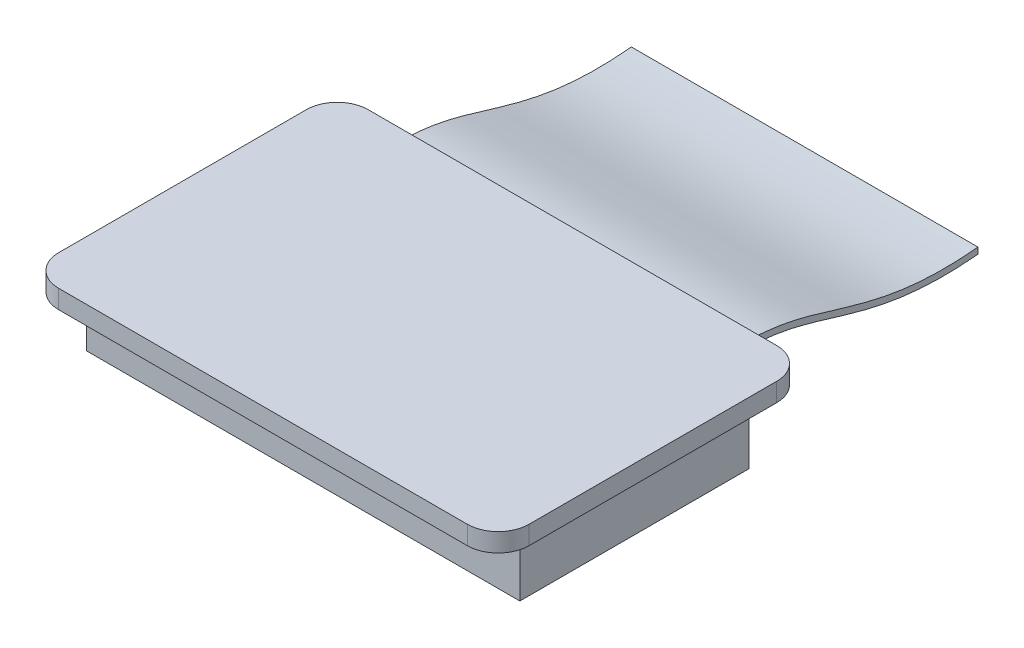
ISO-10303-21;
HEADER;
FILE_DESCRIPTION(('STEP AP214'),'2;1');
FILE_NAME('part.step','',(''),(''),'','','');
FILE_SCHEMA(('AUTOMOTIVE_DESIGN { 1 0 10303 214 1 1 1 1 }'));
ENDSEC;
DATA;
#1=APPLICATION_CONTEXT('core data for automotive mechanical design processes');
#2=APPLICATION_PROTOCOL_DEFINITION('international standard','automotive_design',2000,#1);
#3=PRODUCT_CONTEXT('',#1,'mechanical');
#4=PRODUCT('Part','Part','',(#3));
#5=PRODUCT_RELATED_PRODUCT_CATEGORY('part','',(#4));
#6=PRODUCT_DEFINITION_FORMATION('','',#4);
#7=PRODUCT_DEFINITION_CONTEXT('part definition',#1,'design');
#8=PRODUCT_DEFINITION('design','',#6,#7);
#9=PRODUCT_DEFINITION_SHAPE('','',#8);
#10=(LENGTH_UNIT() NAMED_UNIT(*) SI_UNIT(.MILLI.,.METRE.));
#11=(NAMED_UNIT(*) PLANE_ANGLE_UNIT() SI_UNIT($,.RADIAN.));
#12=(NAMED_UNIT(*) SI_UNIT($,.STERADIAN.) SOLID_ANGLE_UNIT());
#13=UNCERTAINTY_MEASURE_WITH_UNIT(LENGTH_MEASURE(1.E-05),#10,'distance_accuracy_value','');
#14=(GEOMETRIC_REPRESENTATION_CONTEXT(3) GLOBAL_UNCERTAINTY_ASSIGNED_CONTEXT((#13)) GLOBAL_UNIT_ASSIGNED_CONTEXT((#10,
#11,#12)) REPRESENTATION_CONTEXT('',''));
#15=CARTESIAN_POINT('',(0.,0.,0.));
#16=DIRECTION('',(0.,0.,1.));
#17=DIRECTION('',(1.,0.,0.));
#18=AXIS2_PLACEMENT_3D('',#15,#16,#17);
#19=CARTESIAN_POINT('',(3.3,0.748301222298696,8.25169585037883));
#20=DIRECTION('',(0.,-1.,0.));
#21=DIRECTION('',(0.,0.,-1.));
#22=AXIS2_PLACEMENT_3D('',#19,#20,#21);
#23=CYLINDRICAL_SURFACE('',#22,0.5);
#24=CARTESIAN_POINT('',(3.3,0.448301222298696,8.25169585037883));
#25=DIRECTION('',(0.,-1.,0.));
#26=DIRECTION('',(0.,0.,-1.));
#27=AXIS2_PLACEMENT_3D('',#24,#25,#26);
#28=CIRCLE('',#27,0.5);
#29=CARTESIAN_POINT('',(3.3,0.448301222298696,7.75169585037883));
#30=VERTEX_POINT('',#29);
#31=CARTESIAN_POINT('',(3.8,0.448301222298696,8.25169585037883));
#32=VERTEX_POINT('',#31);
#33=EDGE_CURVE('E174',#30,#32,#28,.T.);
#34=ORIENTED_EDGE('',*,*,#33,.F.);
#35=DIRECTION('',(0.,-1.,0.));
#36=VECTOR('',#35,1.);
#37=CARTESIAN_POINT('',(3.3,0.748301222298696,7.75169585037883));
#38=LINE('',#37,#36);
#39=CARTESIAN_POINT('',(3.3,0.748301222298696,7.75169585037883));
#40=VERTEX_POINT('',#39);
#41=EDGE_CURVE('E13',#40,#30,#38,.T.);
#42=ORIENTED_EDGE('',*,*,#41,.F.);
#43=CARTESIAN_POINT('',(3.3,0.748301222298696,8.25169585037883));
#44=DIRECTION('',(0.,-1.,0.));
#45=DIRECTION('',(0.,0.,-1.));
#46=AXIS2_PLACEMENT_3D('',#43,#44,#45);
#47=CIRCLE('',#46,0.5);
#48=CARTESIAN_POINT('',(3.8,0.748301222298696,8.25169585037883));
#49=VERTEX_POINT('',#48);
#50=EDGE_CURVE('E195',#40,#49,#47,.T.);
#51=ORIENTED_EDGE('',*,*,#50,.T.);
#52=DIRECTION('',(0.,-1.,0.));
#53=VECTOR('',#52,1.);
#54=CARTESIAN_POINT('',(3.8,0.748301222298696,8.25169585037883));
#55=LINE('',#54,#53);
#56=EDGE_CURVE('E67',#49,#32,#55,.T.);
#57=ORIENTED_EDGE('',*,*,#56,.T.);
#58=EDGE_LOOP('',(#34,#42,#51,#57));
#59=FACE_BOUND('',#58,.T.);
#60=ADVANCED_FACE('F64',(#59),#23,.T.);
#61=CARTESIAN_POINT('',(-3.3,0.748301222298696,7.75169585037883));
#62=DIRECTION('',(0.,0.,-1.));
#63=DIRECTION('',(-1.,0.,0.));
#64=AXIS2_PLACEMENT_3D('',#61,#62,#63);
#65=PLANE('',#64);
#66=DIRECTION('',(1.,0.,0.));
#67=VECTOR('',#66,1.);
#68=CARTESIAN_POINT('',(-3.3,0.448301222298696,7.75169585037883));
#69=LINE('',#68,#67);
#70=CARTESIAN_POINT('',(-3.3,0.448301222298696,7.75169585037883));
#71=VERTEX_POINT('',#70);
#72=EDGE_CURVE('E193',#71,#30,#69,.T.);
#73=ORIENTED_EDGE('',*,*,#72,.F.);
#74=DIRECTION('',(0.,-1.,0.));
#75=VECTOR('',#74,1.);
#76=CARTESIAN_POINT('',(-3.3,0.748301222298696,7.75169585037883));
#77=LINE('',#76,#75);
#78=CARTESIAN_POINT('',(-3.3,0.748301222298696,7.75169585037883));
#79=VERTEX_POINT('',#78);
#80=EDGE_CURVE('E72',#79,#71,#77,.T.);
#81=ORIENTED_EDGE('',*,*,#80,.F.);
#82=DIRECTION('',(1.,0.,0.));
#83=VECTOR('',#82,1.);
#84=CARTESIAN_POINT('',(-3.3,0.748301222298696,7.75169585037883));
#85=LINE('',#84,#83);
#86=EDGE_CURVE('E164',#79,#40,#85,.T.);
#87=ORIENTED_EDGE('',*,*,#86,.T.);
#88=ORIENTED_EDGE('',*,*,#41,.T.);
#89=EDGE_LOOP('',(#73,#81,#87,#88));
#90=FACE_BOUND('',#89,.T.);
#91=ADVANCED_FACE('F207',(#90),#65,.T.);
#92=CARTESIAN_POINT('',(-3.3,0.748301222298696,8.25169585037883));
#93=DIRECTION('',(0.,-1.,0.));
#94=DIRECTION('',(0.,0.,-1.));
#95=AXIS2_PLACEMENT_3D('',#92,#93,#94);
#96=CYLINDRICAL_SURFACE('',#95,0.5);
#97=CARTESIAN_POINT('',(-3.3,0.448301222298696,8.25169585037883));
#98=DIRECTION('',(0.,-1.,0.));
#99=DIRECTION('',(0.,0.,-1.));
#100=AXIS2_PLACEMENT_3D('',#97,#98,#99);
#101=CIRCLE('',#100,0.5);
#102=CARTESIAN_POINT('',(-3.8,0.448301222298696,8.25169585037883));
#103=VERTEX_POINT('',#102);
#104=EDGE_CURVE('E151',#103,#71,#101,.T.);
#105=ORIENTED_EDGE('',*,*,#104,.F.);
#106=DIRECTION('',(0.,-1.,0.));
#107=VECTOR('',#106,1.);
#108=CARTESIAN_POINT('',(-3.8,0.748301222298696,8.25169585037883));
#109=LINE('',#108,#107);
#110=CARTESIAN_POINT('',(-3.8,0.748301222298696,8.25169585037883));
#111=VERTEX_POINT('',#110);
#112=EDGE_CURVE('E145',#111,#103,#109,.T.);
#113=ORIENTED_EDGE('',*,*,#112,.F.);
#114=CARTESIAN_POINT('',(-3.3,0.748301222298696,8.25169585037883));
#115=DIRECTION('',(0.,-1.,0.));
#116=DIRECTION('',(0.,0.,-1.));
#117=AXIS2_PLACEMENT_3D('',#114,#115,#116);
#118=CIRCLE('',#117,0.5);
#119=EDGE_CURVE('E148',#111,#79,#118,.T.);
#120=ORIENTED_EDGE('',*,*,#119,.T.);
#121=ORIENTED_EDGE('',*,*,#80,.T.);
#122=EDGE_LOOP('',(#105,#113,#120,#121));
#123=FACE_BOUND('',#122,.T.);
#124=ADVANCED_FACE('F147',(#123),#96,.T.);
#125=CARTESIAN_POINT('',(-3.8,0.748301222298696,12.2516958503788));
#126=DIRECTION('',(-1.,0.,0.));
#127=DIRECTION('',(0.,0.,1.));
#128=AXIS2_PLACEMENT_3D('',#125,#126,#127);
#129=PLANE('',#128);
#130=DIRECTION('',(0.,0.,-1.));
#131=VECTOR('',#130,1.);
#132=CARTESIAN_POINT('',(-3.8,0.448301222298696,12.2516958503788));
#133=LINE('',#132,#131);
#134=CARTESIAN_POINT('',(-3.8,0.448301222298696,12.2516958503788));
#135=VERTEX_POINT('',#134);
#136=EDGE_CURVE('E190',#135,#103,#133,.T.);
#137=ORIENTED_EDGE('',*,*,#136,.F.);
#138=DIRECTION('',(0.,-1.,0.));
#139=VECTOR('',#138,1.);
#140=CARTESIAN_POINT('',(-3.8,0.748301222298696,12.2516958503788));
#141=LINE('',#140,#139);
#142=CARTESIAN_POINT('',(-3.8,0.748301222298696,12.2516958503788));
#143=VERTEX_POINT('',#142);
#144=EDGE_CURVE('E156',#143,#135,#141,.T.);
#145=ORIENTED_EDGE('',*,*,#144,.F.);
#146=DIRECTION('',(0.,0.,-1.));
#147=VECTOR('',#146,1.);
#148=CARTESIAN_POINT('',(-3.8,0.748301222298696,12.2516958503788));
#149=LINE('',#148,#147);
#150=EDGE_CURVE('E162',#143,#111,#149,.T.);
#151=ORIENTED_EDGE('',*,*,#150,.T.);
#152=ORIENTED_EDGE('',*,*,#112,.T.);
#153=EDGE_LOOP('',(#137,#145,#151,#152));
#154=FACE_BOUND('',#153,.T.);
#155=ADVANCED_FACE('F166',(#154),#129,.T.);
#156=CARTESIAN_POINT('',(-3.3,0.748301222298696,12.2516958503788));
#157=DIRECTION('',(0.,-1.,0.));
#158=DIRECTION('',(0.,0.,-1.));
#159=AXIS2_PLACEMENT_3D('',#156,#157,#158);
#160=CYLINDRICAL_SURFACE('',#159,0.5);
#161=CARTESIAN_POINT('',(-3.3,0.448301222298696,12.2516958503788));
#162=DIRECTION('',(0.,-1.,0.));
#163=DIRECTION('',(0.,0.,-1.));
#164=AXIS2_PLACEMENT_3D('',#161,#162,#163);
#165=CIRCLE('',#164,0.5);
#166=CARTESIAN_POINT('',(-3.3,0.448301222298696,12.7516958503788));
#167=VERTEX_POINT('',#166);
#168=EDGE_CURVE('E187',#167,#135,#165,.T.);
#169=ORIENTED_EDGE('',*,*,#168,.F.);
#170=DIRECTION('',(0.,-1.,0.));
#171=VECTOR('',#170,1.);
#172=CARTESIAN_POINT('',(-3.3,0.748301222298696,12.7516958503788));
#173=LINE('',#172,#171);
#174=CARTESIAN_POINT('',(-3.3,0.748301222298696,12.7516958503788));
#175=VERTEX_POINT('',#174);
#176=EDGE_CURVE('E199',#175,#167,#173,.T.);
#177=ORIENTED_EDGE('',*,*,#176,.F.);
#178=CARTESIAN_POINT('',(-3.3,0.748301222298696,12.2516958503788));
#179=DIRECTION('',(0.,-1.,0.));
#180=DIRECTION('',(0.,0.,-1.));
#181=AXIS2_PLACEMENT_3D('',#178,#179,#180);
#182=CIRCLE('',#181,0.5);
#183=EDGE_CURVE('E167',#175,#143,#182,.T.);
#184=ORIENTED_EDGE('',*,*,#183,.T.);
#185=ORIENTED_EDGE('',*,*,#144,.T.);
#186=EDGE_LOOP('',(#169,#177,#184,#185));
#187=FACE_BOUND('',#186,.T.);
#188=ADVANCED_FACE('F220',(#187),#160,.T.);
#189=CARTESIAN_POINT('',(-3.3,0.748301222298696,12.7516958503788));
#190=DIRECTION('',(0.,0.,1.));
#191=DIRECTION('',(1.,0.,0.));
#192=AXIS2_PLACEMENT_3D('',#189,#190,#191);
#193=PLANE('',#192);
#194=DIRECTION('',(-1.,0.,0.));
#195=VECTOR('',#194,1.);
#196=CARTESIAN_POINT('',(-3.3,0.448301222298696,12.7516958503788));
#197=LINE('',#196,#195);
#198=CARTESIAN_POINT('',(3.3,0.448301222298696,12.7516958503788));
#199=VERTEX_POINT('',#198);
#200=EDGE_CURVE('E184',#199,#167,#197,.T.);
#201=ORIENTED_EDGE('',*,*,#200,.F.);
#202=DIRECTION('',(0.,-1.,0.));
#203=VECTOR('',#202,1.);
#204=CARTESIAN_POINT('',(3.3,0.748301222298696,12.7516958503788));
#205=LINE('',#204,#203);
#206=CARTESIAN_POINT('',(3.3,0.748301222298696,12.7516958503788));
#207=VERTEX_POINT('',#206);
#208=EDGE_CURVE('E201',#207,#199,#205,.T.);
#209=ORIENTED_EDGE('',*,*,#208,.F.);
#210=DIRECTION('',(-1.,0.,0.));
#211=VECTOR('',#210,1.);
#212=CARTESIAN_POINT('',(-3.3,0.748301222298696,12.7516958503788));
#213=LINE('',#212,#211);
#214=EDGE_CURVE('E169',#207,#175,#213,.T.);
#215=ORIENTED_EDGE('',*,*,#214,.T.);
#216=ORIENTED_EDGE('',*,*,#176,.T.);
#217=EDGE_LOOP('',(#201,#209,#215,#216));
#218=FACE_BOUND('',#217,.T.);
#219=ADVANCED_FACE('F223',(#218),#193,.T.);
#220=CARTESIAN_POINT('',(3.3,0.748301222298696,12.2516958503788));
#221=DIRECTION('',(0.,-1.,0.));
#222=DIRECTION('',(0.,0.,-1.));
#223=AXIS2_PLACEMENT_3D('',#220,#221,#222);
#224=CYLINDRICAL_SURFACE('',#223,0.5);
#225=CARTESIAN_POINT('',(3.3,0.448301222298696,12.2516958503788));
#226=DIRECTION('',(0.,-1.,0.));
#227=DIRECTION('',(0.,0.,1.));
#228=AXIS2_PLACEMENT_3D('',#225,#226,#227);
#229=CIRCLE('',#228,0.5);
#230=CARTESIAN_POINT('',(3.8,0.448301222298696,12.2516958503788));
#231=VERTEX_POINT('',#230);
#232=EDGE_CURVE('E181',#231,#199,#229,.T.);
#233=ORIENTED_EDGE('',*,*,#232,.F.);
#234=DIRECTION('',(0.,-1.,0.));
#235=VECTOR('',#234,1.);
#236=CARTESIAN_POINT('',(3.8,0.748301222298696,12.2516958503788));
#237=LINE('',#236,#235);
#238=CARTESIAN_POINT('',(3.8,0.748301222298696,12.2516958503788));
#239=VERTEX_POINT('',#238);
#240=EDGE_CURVE('E202',#239,#231,#237,.T.);
#241=ORIENTED_EDGE('',*,*,#240,.F.);
#242=CARTESIAN_POINT('',(3.3,0.748301222298696,12.2516958503788));
#243=DIRECTION('',(0.,-1.,0.));
#244=DIRECTION('',(0.,0.,1.));
#245=AXIS2_PLACEMENT_3D('',#242,#243,#244);
#246=CIRCLE('',#245,0.5);
#247=EDGE_CURVE('E291',#239,#207,#246,.T.);
#248=ORIENTED_EDGE('',*,*,#247,.T.);
#249=ORIENTED_EDGE('',*,*,#208,.T.);
#250=EDGE_LOOP('',(#233,#241,#248,#249));
#251=FACE_BOUND('',#250,.T.);
#252=ADVANCED_FACE('F227',(#251),#224,.T.);
#253=CARTESIAN_POINT('',(3.8,0.748301222298696,12.2516958503788));
#254=DIRECTION('',(1.,0.,0.));
#255=DIRECTION('',(0.,0.,-1.));
#256=AXIS2_PLACEMENT_3D('',#253,#254,#255);
#257=PLANE('',#256);
#258=DIRECTION('',(0.,0.,1.));
#259=VECTOR('',#258,1.);
#260=CARTESIAN_POINT('',(3.8,0.448301222298696,12.2516958503788));
#261=LINE('',#260,#259);
#262=EDGE_CURVE('E177',#32,#231,#261,.T.);
#263=ORIENTED_EDGE('',*,*,#262,.F.);
#264=ORIENTED_EDGE('',*,*,#56,.F.);
#265=DIRECTION('',(0.,0.,1.));
#266=VECTOR('',#265,1.);
#267=CARTESIAN_POINT('',(3.8,0.748301222298696,12.2516958503788));
#268=LINE('',#267,#266);
#269=EDGE_CURVE('E289',#49,#239,#268,.T.);
#270=ORIENTED_EDGE('',*,*,#269,.T.);
#271=ORIENTED_EDGE('',*,*,#240,.T.);
#272=EDGE_LOOP('',(#263,#264,#270,#271));
#273=FACE_BOUND('',#272,.T.);
#274=ADVANCED_FACE('F204',(#273),#257,.T.);
#275=CARTESIAN_POINT('',(3.3,0.748301222298696,8.25169585037883));
#276=DIRECTION('',(0.,-1.,0.));
#277=DIRECTION('',(0.,0.,-1.));
#278=AXIS2_PLACEMENT_3D('',#275,#276,#277);
#279=PLANE('',#278);
#280=ORIENTED_EDGE('',*,*,#50,.F.);
#281=ORIENTED_EDGE('',*,*,#86,.F.);
#282=ORIENTED_EDGE('',*,*,#119,.F.);
#283=ORIENTED_EDGE('',*,*,#150,.F.);
#284=ORIENTED_EDGE('',*,*,#183,.F.);
#285=ORIENTED_EDGE('',*,*,#214,.F.);
#286=ORIENTED_EDGE('',*,*,#247,.F.);
#287=ORIENTED_EDGE('',*,*,#269,.F.);
#288=EDGE_LOOP('',(#280,#281,#282,#283,#284,#285,#286,#287));
#289=FACE_BOUND('',#288,.T.);
#290=ADVANCED_FACE('F160',(#289),#279,.F.);
#291=CARTESIAN_POINT('',(3.3,0.448301222298696,8.25169585037883));
#292=DIRECTION('',(0.,-1.,0.));
#293=DIRECTION('',(0.,0.,-1.));
#294=AXIS2_PLACEMENT_3D('',#291,#292,#293);
#295=PLANE('',#294);
#296=DIRECTION('',(0.,0.,1.));
#297=VECTOR('',#296,1.);
#298=CARTESIAN_POINT('',(3.5,0.448301222298696,12.1016958503788));
#299=LINE('',#298,#297);
#300=CARTESIAN_POINT('',(3.5,0.448301222298696,8.40169585037883));
#301=VERTEX_POINT('',#300);
#302=CARTESIAN_POINT('',(3.5,0.448301222298696,12.1016958503788));
#303=VERTEX_POINT('',#302);
#304=EDGE_CURVE('E273',#301,#303,#299,.T.);
#305=ORIENTED_EDGE('',*,*,#304,.F.);
#306=DIRECTION('',(-1.,0.,0.));
#307=VECTOR('',#306,1.);
#308=CARTESIAN_POINT('',(3.5,0.448301222298696,8.40169585037883));
#309=LINE('',#308,#307);
#310=CARTESIAN_POINT('',(-3.5,0.448301222298696,8.40169585037883));
#311=VERTEX_POINT('',#310);
#312=EDGE_CURVE('E284',#301,#311,#309,.T.);
#313=ORIENTED_EDGE('',*,*,#312,.T.);
#314=DIRECTION('',(0.,0.,1.));
#315=VECTOR('',#314,1.);
#316=CARTESIAN_POINT('',(-3.5,0.448301222298696,12.1016958503788));
#317=LINE('',#316,#315);
#318=CARTESIAN_POINT('',(-3.5,0.448301222298696,12.1016958503788));
#319=VERTEX_POINT('',#318);
#320=EDGE_CURVE('E276',#311,#319,#317,.T.);
#321=ORIENTED_EDGE('',*,*,#320,.T.);
#322=DIRECTION('',(-1.,0.,0.));
#323=VECTOR('',#322,1.);
#324=CARTESIAN_POINT('',(3.5,0.448301222298696,12.1016958503788));
#325=LINE('',#324,#323);
#326=EDGE_CURVE('E300',#303,#319,#325,.T.);
#327=ORIENTED_EDGE('',*,*,#326,.F.);
#328=EDGE_LOOP('',(#305,#313,#321,#327));
#329=FACE_BOUND('',#328,.T.);
#330=ORIENTED_EDGE('',*,*,#33,.T.);
#331=ORIENTED_EDGE('',*,*,#262,.T.);
#332=ORIENTED_EDGE('',*,*,#232,.T.);
#333=ORIENTED_EDGE('',*,*,#200,.T.);
#334=ORIENTED_EDGE('',*,*,#168,.T.);
#335=ORIENTED_EDGE('',*,*,#136,.T.);
#336=ORIENTED_EDGE('',*,*,#104,.T.);
#337=ORIENTED_EDGE('',*,*,#72,.T.);
#338=EDGE_LOOP('',(#330,#331,#332,#333,#334,#335,#336,#337));
#339=FACE_BOUND('',#338,.T.);
#340=ADVANCED_FACE('F206',(#329,#339),#295,.T.);
#341=CARTESIAN_POINT('',(3.5,0.448301222298696,12.1016958503788));
#342=DIRECTION('',(0.,0.,-1.));
#343=DIRECTION('',(-1.,0.,0.));
#344=AXIS2_PLACEMENT_3D('',#341,#342,#343);
#345=PLANE('',#344);
#346=DIRECTION('',(0.,-1.,0.));
#347=VECTOR('',#346,1.);
#348=CARTESIAN_POINT('',(-3.5,0.448301222298696,12.1016958503788));
#349=LINE('',#348,#347);
#350=CARTESIAN_POINT('',(-3.5,-0.551698777701304,12.1016958503788));
#351=VERTEX_POINT('',#350);
#352=EDGE_CURVE('E80',#319,#351,#349,.T.);
#353=ORIENTED_EDGE('',*,*,#352,.T.);
#354=DIRECTION('',(-1.,0.,0.));
#355=VECTOR('',#354,1.);
#356=CARTESIAN_POINT('',(3.5,-0.551698777701304,12.1016958503788));
#357=LINE('',#356,#355);
#358=CARTESIAN_POINT('',(3.5,-0.551698777701304,12.1016958503788));
#359=VERTEX_POINT('',#358);
#360=EDGE_CURVE('E178',#359,#351,#357,.T.);
#361=ORIENTED_EDGE('',*,*,#360,.F.);
#362=DIRECTION('',(0.,-1.,0.));
#363=VECTOR('',#362,1.);
#364=CARTESIAN_POINT('',(3.5,0.448301222298696,12.1016958503788));
#365=LINE('',#364,#363);
#366=EDGE_CURVE('E265',#303,#359,#365,.T.);
#367=ORIENTED_EDGE('',*,*,#366,.F.);
#368=ORIENTED_EDGE('',*,*,#326,.T.);
#369=EDGE_LOOP('',(#353,#361,#367,#368));
#370=FACE_BOUND('',#369,.T.);
#371=ADVANCED_FACE('F238',(#370),#345,.F.);
#372=CARTESIAN_POINT('',(3.5,-0.551698777701304,12.1016958503788));
#373=DIRECTION('',(0.,1.,0.));
#374=DIRECTION('',(0.,0.,1.));
#375=AXIS2_PLACEMENT_3D('',#372,#373,#374);
#376=PLANE('',#375);
#377=DIRECTION('',(0.,0.,-1.));
#378=VECTOR('',#377,1.);
#379=CARTESIAN_POINT('',(-3.5,-0.551698777701304,12.1016958503788));
#380=LINE('',#379,#378);
#381=CARTESIAN_POINT('',(-3.5,-0.551698777701304,8.40169585037883));
#382=VERTEX_POINT('',#381);
#383=EDGE_CURVE('E307',#351,#382,#380,.T.);
#384=ORIENTED_EDGE('',*,*,#383,.T.);
#385=DIRECTION('',(-1.,0.,0.));
#386=VECTOR('',#385,1.);
#387=CARTESIAN_POINT('',(3.5,-0.551698777701304,8.40169585037883));
#388=LINE('',#387,#386);
#389=CARTESIAN_POINT('',(3.5,-0.551698777701304,8.40169585037883));
#390=VERTEX_POINT('',#389);
#391=EDGE_CURVE('E281',#390,#382,#388,.T.);
#392=ORIENTED_EDGE('',*,*,#391,.F.);
#393=DIRECTION('',(0.,0.,-1.));
#394=VECTOR('',#393,1.);
#395=CARTESIAN_POINT('',(3.5,-0.551698777701304,12.1016958503788));
#396=LINE('',#395,#394);
#397=EDGE_CURVE('E270',#359,#390,#396,.T.);
#398=ORIENTED_EDGE('',*,*,#397,.F.);
#399=ORIENTED_EDGE('',*,*,#360,.T.);
#400=EDGE_LOOP('',(#384,#392,#398,#399));
#401=FACE_BOUND('',#400,.T.);
#402=ADVANCED_FACE('F243',(#401),#376,.F.);
#403=CARTESIAN_POINT('',(3.5,0.448301222298696,8.40169585037883));
#404=DIRECTION('',(0.,0.,1.));
#405=DIRECTION('',(1.,0.,0.));
#406=AXIS2_PLACEMENT_3D('',#403,#404,#405);
#407=PLANE('',#406);
#408=DIRECTION('',(0.,1.,0.));
#409=VECTOR('',#408,1.);
#410=CARTESIAN_POINT('',(-3.5,0.448301222298696,8.40169585037883));
#411=LINE('',#410,#409);
#412=EDGE_CURVE('E304',#382,#311,#411,.T.);
#413=ORIENTED_EDGE('',*,*,#412,.T.);
#414=ORIENTED_EDGE('',*,*,#312,.F.);
#415=DIRECTION('',(0.,1.,0.));
#416=VECTOR('',#415,1.);
#417=CARTESIAN_POINT('',(3.5,0.448301222298696,8.40169585037883));
#418=LINE('',#417,#416);
#419=EDGE_CURVE('E311',#390,#301,#418,.T.);
#420=ORIENTED_EDGE('',*,*,#419,.F.);
#421=ORIENTED_EDGE('',*,*,#391,.T.);
#422=EDGE_LOOP('',(#413,#414,#420,#421));
#423=FACE_BOUND('',#422,.T.);
#424=ADVANCED_FACE('F247',(#423),#407,.F.);
#425=CARTESIAN_POINT('',(3.5,0.,0.));
#426=DIRECTION('',(1.,0.,0.));
#427=DIRECTION('',(0.,0.,-1.));
#428=AXIS2_PLACEMENT_3D('',#425,#426,#427);
#429=PLANE('',#428);
#430=ORIENTED_EDGE('',*,*,#366,.T.);
#431=ORIENTED_EDGE('',*,*,#397,.T.);
#432=ORIENTED_EDGE('',*,*,#419,.T.);
#433=ORIENTED_EDGE('',*,*,#304,.T.);
#434=EDGE_LOOP('',(#430,#431,#432,#433));
#435=FACE_BOUND('',#434,.T.);
#436=ADVANCED_FACE('F251',(#435),#429,.T.);
#437=CARTESIAN_POINT('',(-3.5,0.,0.));
#438=DIRECTION('',(1.,0.,0.));
#439=DIRECTION('',(0.,0.,-1.));
#440=AXIS2_PLACEMENT_3D('',#437,#438,#439);
#441=PLANE('',#440);
#442=ORIENTED_EDGE('',*,*,#352,.F.);
#443=ORIENTED_EDGE('',*,*,#320,.F.);
#444=ORIENTED_EDGE('',*,*,#412,.F.);
#445=ORIENTED_EDGE('',*,*,#383,.F.);
#446=EDGE_LOOP('',(#442,#443,#444,#445));
#447=FACE_BOUND('',#446,.T.);
#448=ADVANCED_FACE('F253',(#447),#441,.F.);
#449=CLOSED_SHELL('',(#60,#91,#124,#155,#188,#219,#252,#274,#290,#340,#371,#402,#424,#436,#448));
#450=MANIFOLD_SOLID_BREP('B2',#449);
#451=CARTESIAN_POINT('',(0.,0.547843022465262,7.74213394577779));
#452=DIRECTION('',(0.,0.0956190460103406,0.995418001665668));
#453=DIRECTION('',(1.,0.,0.));
#454=AXIS2_PLACEMENT_3D('',#451,#452,#453);
#455=PLANE('',#454);
#456=DIRECTION('',(0.,-0.995418001665668,0.0956190460103406));
#457=VECTOR('',#456,1.);
#458=CARTESIAN_POINT('',(-2.8,0.547843022465262,7.74213394577779));
#459=LINE('',#458,#457);
#460=CARTESIAN_POINT('',(-2.8,0.547843022465262,7.74213394577779));
#461=VERTEX_POINT('',#460);
#462=CARTESIAN_POINT('',(-2.8,0.448301222298696,7.75169585037883));
#463=VERTEX_POINT('',#462);
#464=EDGE_CURVE('E451',#461,#463,#459,.T.);
#465=ORIENTED_EDGE('',*,*,#464,.T.);
#466=DIRECTION('',(1.,0.,0.));
#467=VECTOR('',#466,1.);
#468=CARTESIAN_POINT('',(-2.8,0.448301222298696,7.75169585037883));
#469=LINE('',#468,#467);
#470=CARTESIAN_POINT('',(2.8,0.448301222298696,7.75169585037883));
#471=VERTEX_POINT('',#470);
#472=EDGE_CURVE('E457',#463,#471,#469,.T.);
#473=ORIENTED_EDGE('',*,*,#472,.T.);
#474=DIRECTION('',(0.,0.995418001665668,-0.0956190460103406));
#475=VECTOR('',#474,1.);
#476=CARTESIAN_POINT('',(2.8,0.547843022465263,7.74213394577779));
#477=LINE('',#476,#475);
#478=CARTESIAN_POINT('',(2.8,0.547843022465263,7.74213394577779));
#479=VERTEX_POINT('',#478);
#480=EDGE_CURVE('E452',#471,#479,#477,.T.);
#481=ORIENTED_EDGE('',*,*,#480,.T.);
#482=DIRECTION('',(-1.,0.,0.));
#483=VECTOR('',#482,1.);
#484=CARTESIAN_POINT('',(-2.8,0.547843022465262,7.74213394577779));
#485=LINE('',#484,#483);
#486=EDGE_CURVE('E412',#479,#461,#485,.T.);
#487=ORIENTED_EDGE('',*,*,#486,.T.);
#488=EDGE_LOOP('',(#465,#473,#481,#487));
#489=FACE_BOUND('',#488,.T.);
#490=ADVANCED_FACE('F408',(#489),#455,.T.);
#491=CARTESIAN_POINT('',(0.,0.,3.99999999999998));
#492=DIRECTION('',(0.,0.,1.));
#493=DIRECTION('',(1.,0.,0.));
#494=AXIS2_PLACEMENT_3D('',#491,#492,#493);
#495=PLANE('',#494);
#496=DIRECTION('',(0.,-1.,0.));
#497=VECTOR('',#496,1.);
#498=CARTESIAN_POINT('',(-2.8,0.,3.99999999999998));
#499=LINE('',#498,#497);
#500=CARTESIAN_POINT('',(-2.8,0.,3.99999999999998));
#501=VERTEX_POINT('',#500);
#502=CARTESIAN_POINT('',(-2.8,-0.0999999999999998,3.99999999999998));
#503=VERTEX_POINT('',#502);
#504=EDGE_CURVE('E461',#501,#503,#499,.T.);
#505=ORIENTED_EDGE('',*,*,#504,.F.);
#506=DIRECTION('',(-1.,0.,0.));
#507=VECTOR('',#506,1.);
#508=CARTESIAN_POINT('',(-2.8,0.,3.99999999999998));
#509=LINE('',#508,#507);
#510=CARTESIAN_POINT('',(2.8,0.,3.99999999999998));
#511=VERTEX_POINT('',#510);
#512=EDGE_CURVE('E62',#511,#501,#509,.T.);
#513=ORIENTED_EDGE('',*,*,#512,.F.);
#514=DIRECTION('',(0.,1.,0.));
#515=VECTOR('',#514,1.);
#516=CARTESIAN_POINT('',(2.8,0.,3.99999999999998));
#517=LINE('',#516,#515);
#518=CARTESIAN_POINT('',(2.8,-0.0999999999999998,3.99999999999998));
#519=VERTEX_POINT('',#518);
#520=EDGE_CURVE('E418',#519,#511,#517,.T.);
#521=ORIENTED_EDGE('',*,*,#520,.F.);
#522=DIRECTION('',(1.,0.,0.));
#523=VECTOR('',#522,1.);
#524=CARTESIAN_POINT('',(-2.8,-0.0999999999999998,3.99999999999998));
#525=LINE('',#524,#523);
#526=EDGE_CURVE('E463',#503,#519,#525,.T.);
#527=ORIENTED_EDGE('',*,*,#526,.F.);
#528=EDGE_LOOP('',(#505,#513,#521,#527));
#529=FACE_BOUND('',#528,.T.);
#530=ADVANCED_FACE('F501',(#529),#495,.F.);
#531=CARTESIAN_POINT('',(2.8,0.,3.99999999999998));
#532=CARTESIAN_POINT('',(2.8,-0.024628468128532,4.25638846601688));
#533=CARTESIAN_POINT('',(2.8,-0.0386180157529813,4.72259081002346));
#534=CARTESIAN_POINT('',(2.8,0.0194715301087126,5.3120111853385));
#535=CARTESIAN_POINT('',(2.8,0.129906644668738,5.82138904334296));
#536=CARTESIAN_POINT('',(2.8,0.291873769263778,6.3680270958267));
#537=CARTESIAN_POINT('',(2.8,0.477782991355757,6.96597559310496));
#538=CARTESIAN_POINT('',(2.8,0.547843022465264,7.46326880544397));
#539=CARTESIAN_POINT('',(2.8,0.547843022465264,7.74213394577779));
#540=CARTESIAN_POINT('',(-2.8,0.,3.99999999999998));
#541=CARTESIAN_POINT('',(-2.8,-0.0246284681285331,4.25638846601688));
#542=CARTESIAN_POINT('',(-2.8,-0.0386180157529824,4.72259081002346));
#543=CARTESIAN_POINT('',(-2.8,0.0194715301087115,5.3120111853385));
#544=CARTESIAN_POINT('',(-2.8,0.129906644668737,5.82138904334296));
#545=CARTESIAN_POINT('',(-2.8,0.291873769263777,6.3680270958267));
#546=CARTESIAN_POINT('',(-2.8,0.477782991355756,6.96597559310497));
#547=CARTESIAN_POINT('',(-2.8,0.547843022465263,7.46326880544397));
#548=CARTESIAN_POINT('',(-2.8,0.547843022465263,7.74213394577779));
#549=B_SPLINE_SURFACE_WITH_KNOTS('',1,3,((#531,#532,#533,#534,#535,#536,#537,#538,#539),(#540,
#541,#542,#543,#544,#545,#546,#547,#548)),.UNSPECIFIED.,.F.,.F.,.F.,(2,2),(4,1,1,1,1,1,4),
(0.508771929824561,1.),(0.,0.14,0.28,0.42,0.559999999997895,0.780000000000162,1.),.UNSPECIFIED.);
#550=CARTESIAN_POINT('',(-2.8,0.,3.99999999999998));
#551=CARTESIAN_POINT('',(-2.8,-0.0246284681285331,4.25638846601688));
#552=CARTESIAN_POINT('',(-2.8,-0.0386180157529824,4.72259081002346));
#553=CARTESIAN_POINT('',(-2.8,0.0194715301087115,5.3120111853385));
#554=CARTESIAN_POINT('',(-2.8,0.129906644668737,5.82138904334296));
#555=CARTESIAN_POINT('',(-2.8,0.291873769263777,6.3680270958267));
#556=CARTESIAN_POINT('',(-2.8,0.477782991355756,6.96597559310497));
#557=CARTESIAN_POINT('',(-2.8,0.547843022465263,7.46326880544397));
#558=CARTESIAN_POINT('',(-2.8,0.547843022465263,7.74213394577779));
#559=B_SPLINE_CURVE_WITH_KNOTS('',3,(#550,#551,#552,#553,#554,#555,#556,#557,#558),
.UNSPECIFIED.,.F.,.F.,(4,1,1,1,1,1,4),(0.,0.14,0.28,0.42,0.559999999997895,0.780000000000162,
1.),.UNSPECIFIED.);
#560=EDGE_CURVE('E427',#501,#461,#559,.T.);
#561=CARTESIAN_POINT('',(2.8,0.,3.99999999999998));
#562=CARTESIAN_POINT('',(2.8,-0.024628468128532,4.25638846601688));
#563=CARTESIAN_POINT('',(2.8,-0.0386180157529813,4.72259081002346));
#564=CARTESIAN_POINT('',(2.8,0.0194715301087126,5.3120111853385));
#565=CARTESIAN_POINT('',(2.8,0.129906644668738,5.82138904334296));
#566=CARTESIAN_POINT('',(2.8,0.291873769263778,6.3680270958267));
#567=CARTESIAN_POINT('',(2.8,0.477782991355757,6.96597559310496));
#568=CARTESIAN_POINT('',(2.8,0.547843022465264,7.46326880544397));
#569=CARTESIAN_POINT('',(2.8,0.547843022465264,7.74213394577779));
#570=B_SPLINE_CURVE_WITH_KNOTS('',3,(#561,#562,#563,#564,#565,#566,#567,#568,#569),
.UNSPECIFIED.,.F.,.F.,(4,1,1,1,1,1,4),(0.,0.14,0.28,0.42,0.559999999997895,0.780000000000162,
1.),.UNSPECIFIED.);
#571=EDGE_CURVE('E444',#511,#479,#570,.T.);
#572=ORIENTED_EDGE('',*,*,#512,.T.);
#573=ORIENTED_EDGE('',*,*,#560,.T.);
#574=ORIENTED_EDGE('',*,*,#486,.F.);
#575=ORIENTED_EDGE('',*,*,#571,.F.);
#576=EDGE_LOOP('',(#572,#573,#574,#575));
#577=FACE_BOUND('',#576,.T.);
#578=ADVANCED_FACE('F459',(#577),#549,.T.);
#579=CARTESIAN_POINT('',(2.8,-0.0999999999999998,3.99999999999998));
#580=DIRECTION('',(1.,0.,0.));
#581=DIRECTION('',(0.,1.,0.));
#582=AXIS2_PLACEMENT_3D('',#579,#580,#581);
#583=PLANE('',#582);
#584=ORIENTED_EDGE('',*,*,#520,.T.);
#585=ORIENTED_EDGE('',*,*,#571,.T.);
#586=ORIENTED_EDGE('',*,*,#480,.F.);
#587=CARTESIAN_POINT('',(2.8,-0.0999999999999998,3.99999999999998));
#588=CARTESIAN_POINT('',(2.8,-0.124487822602086,4.2605128606233));
#589=CARTESIAN_POINT('',(2.8,-0.13819607917364,4.73496399384273));
#590=CARTESIAN_POINT('',(2.8,-0.0775684463145837,5.33705516657012));
#591=CARTESIAN_POINT('',(2.8,0.0359942616894103,5.85609097163903));
#592=CARTESIAN_POINT('',(2.8,0.200282397231649,6.40790162664091));
#593=CARTESIAN_POINT('',(2.8,0.38279321622902,6.99976726735009));
#594=CARTESIAN_POINT('',(2.8,0.449818563978634,7.48090729992634));
#595=CARTESIAN_POINT('',(2.8,0.448301222298696,7.75169585037883));
#596=B_SPLINE_CURVE_WITH_KNOTS('',3,(#587,#588,#589,#590,#591,#592,#593,#594,#595),
.UNSPECIFIED.,.F.,.F.,(4,1,1,1,1,1,4),(0.,0.14,0.28,0.42,0.559999999997895,0.780000000000162,
1.),.UNSPECIFIED.);
#597=EDGE_CURVE('E465',#519,#471,#596,.T.);
#598=ORIENTED_EDGE('',*,*,#597,.F.);
#599=EDGE_LOOP('',(#584,#585,#586,#598));
#600=FACE_BOUND('',#599,.T.);
#601=ADVANCED_FACE('F497',(#600),#583,.T.);
#602=CARTESIAN_POINT('',(-2.8,-0.0999999999999998,3.99999999999998));
#603=CARTESIAN_POINT('',(-2.8,-0.124487822602086,4.2605128606233));
#604=CARTESIAN_POINT('',(-2.8,-0.13819607917364,4.73496399384273));
#605=CARTESIAN_POINT('',(-2.8,-0.0775684463145837,5.33705516657012));
#606=CARTESIAN_POINT('',(-2.8,0.0359942616894103,5.85609097163903));
#607=CARTESIAN_POINT('',(-2.8,0.200282397231649,6.40790162664091));
#608=CARTESIAN_POINT('',(-2.8,0.38279321622902,6.99976726735009));
#609=CARTESIAN_POINT('',(-2.8,0.449818563978634,7.48090729992634));
#610=CARTESIAN_POINT('',(-2.8,0.448301222298696,7.75169585037883));
#611=CARTESIAN_POINT('',(2.8,-0.0999999999999998,3.99999999999998));
#612=CARTESIAN_POINT('',(2.8,-0.124487822602086,4.2605128606233));
#613=CARTESIAN_POINT('',(2.8,-0.13819607917364,4.73496399384273));
#614=CARTESIAN_POINT('',(2.8,-0.0775684463145837,5.33705516657012));
#615=CARTESIAN_POINT('',(2.8,0.0359942616894103,5.85609097163903));
#616=CARTESIAN_POINT('',(2.8,0.200282397231649,6.40790162664091));
#617=CARTESIAN_POINT('',(2.8,0.38279321622902,6.99976726735009));
#618=CARTESIAN_POINT('',(2.8,0.449818563978634,7.48090729992634));
#619=CARTESIAN_POINT('',(2.8,0.448301222298696,7.75169585037883));
#620=B_SPLINE_SURFACE_WITH_KNOTS('',1,3,((#602,#603,#604,#605,#606,#607,#608,#609,#610),(#611,
#612,#613,#614,#615,#616,#617,#618,#619)),.UNSPECIFIED.,.F.,.F.,.F.,(2,2),(4,1,1,1,1,1,4),
(0.00877192982456138,0.5),(0.,0.14,0.28,0.42,0.559999999997895,0.780000000000162,1.),.UNSPECIFIED.);
#621=CARTESIAN_POINT('',(-2.8,-0.0999999999999998,3.99999999999998));
#622=CARTESIAN_POINT('',(-2.8,-0.124487822602086,4.2605128606233));
#623=CARTESIAN_POINT('',(-2.8,-0.13819607917364,4.73496399384273));
#624=CARTESIAN_POINT('',(-2.8,-0.0775684463145837,5.33705516657012));
#625=CARTESIAN_POINT('',(-2.8,0.0359942616894103,5.85609097163903));
#626=CARTESIAN_POINT('',(-2.8,0.200282397231649,6.40790162664091));
#627=CARTESIAN_POINT('',(-2.8,0.38279321622902,6.99976726735009));
#628=CARTESIAN_POINT('',(-2.8,0.449818563978634,7.48090729992634));
#629=CARTESIAN_POINT('',(-2.8,0.448301222298696,7.75169585037883));
#630=B_SPLINE_CURVE_WITH_KNOTS('',3,(#621,#622,#623,#624,#625,#626,#627,#628,#629),
.UNSPECIFIED.,.F.,.F.,(4,1,1,1,1,1,4),(0.,0.14,0.28,0.42,0.559999999997895,0.780000000000162,
1.),.UNSPECIFIED.);
#631=EDGE_CURVE('E454',#503,#463,#630,.T.);
#632=ORIENTED_EDGE('',*,*,#526,.T.);
#633=ORIENTED_EDGE('',*,*,#597,.T.);
#634=ORIENTED_EDGE('',*,*,#472,.F.);
#635=ORIENTED_EDGE('',*,*,#631,.F.);
#636=EDGE_LOOP('',(#632,#633,#634,#635));
#637=FACE_BOUND('',#636,.T.);
#638=ADVANCED_FACE('F494',(#637),#620,.T.);
#639=CARTESIAN_POINT('',(-2.8,0.,3.99999999999998));
#640=DIRECTION('',(-1.,0.,0.));
#641=DIRECTION('',(0.,-1.,0.));
#642=AXIS2_PLACEMENT_3D('',#639,#640,#641);
#643=PLANE('',#642);
#644=ORIENTED_EDGE('',*,*,#504,.T.);
#645=ORIENTED_EDGE('',*,*,#631,.T.);
#646=ORIENTED_EDGE('',*,*,#464,.F.);
#647=ORIENTED_EDGE('',*,*,#560,.F.);
#648=EDGE_LOOP('',(#644,#645,#646,#647));
#649=FACE_BOUND('',#648,.T.);
#650=ADVANCED_FACE('F410',(#649),#643,.T.);
#651=CLOSED_SHELL('',(#490,#530,#578,#601,#638,#650));
#652=MANIFOLD_SOLID_BREP('B7',#651);
#653=ADVANCED_BREP_SHAPE_REPRESENTATION('',(#18,#450,#652),#14);
#654=SHAPE_DEFINITION_REPRESENTATION(#9,#653);
ENDSEC;
END-ISO-10303-21;
